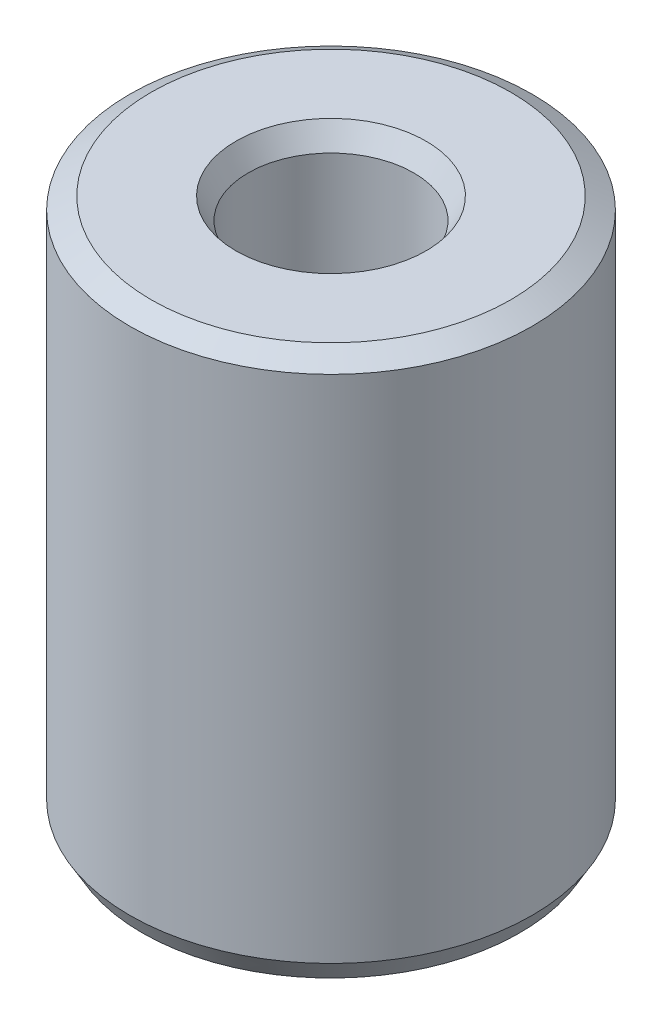
ISO-10303-21;
HEADER;
FILE_DESCRIPTION(('STEP AP214'),'2;1');
FILE_NAME('part.step','',(''),(''),'','','');
FILE_SCHEMA(('AUTOMOTIVE_DESIGN { 1 0 10303 214 1 1 1 1 }'));
ENDSEC;
DATA;
#1=APPLICATION_CONTEXT('core data for automotive mechanical design processes');
#2=APPLICATION_PROTOCOL_DEFINITION('international standard','automotive_design',2000,#1);
#3=PRODUCT_CONTEXT('',#1,'mechanical');
#4=PRODUCT('Part','Part','',(#3));
#5=PRODUCT_RELATED_PRODUCT_CATEGORY('part','',(#4));
#6=PRODUCT_DEFINITION_FORMATION('','',#4);
#7=PRODUCT_DEFINITION_CONTEXT('part definition',#1,'design');
#8=PRODUCT_DEFINITION('design','',#6,#7);
#9=PRODUCT_DEFINITION_SHAPE('','',#8);
#10=(LENGTH_UNIT() NAMED_UNIT(*) SI_UNIT(.MILLI.,.METRE.));
#11=(NAMED_UNIT(*) PLANE_ANGLE_UNIT() SI_UNIT($,.RADIAN.));
#12=(NAMED_UNIT(*) SI_UNIT($,.STERADIAN.) SOLID_ANGLE_UNIT());
#13=UNCERTAINTY_MEASURE_WITH_UNIT(LENGTH_MEASURE(1.E-05),#10,'distance_accuracy_value','');
#14=(GEOMETRIC_REPRESENTATION_CONTEXT(3) GLOBAL_UNCERTAINTY_ASSIGNED_CONTEXT((#13)) GLOBAL_UNIT_ASSIGNED_CONTEXT((#10,
#11,#12)) REPRESENTATION_CONTEXT('',''));
#15=CARTESIAN_POINT('',(0.,0.,0.));
#16=DIRECTION('',(0.,0.,1.));
#17=DIRECTION('',(1.,0.,0.));
#18=AXIS2_PLACEMENT_3D('',#15,#16,#17);
#19=CARTESIAN_POINT('',(0.,148.714564404981,0.));
#20=DIRECTION('',(0.,-1.,0.));
#21=DIRECTION('',(0.,0.,-1.));
#22=AXIS2_PLACEMENT_3D('',#19,#20,#21);
#23=CYLINDRICAL_SURFACE('',#22,55.);
#24=CARTESIAN_POINT('',(0.,5.82980812006137,0.));
#25=DIRECTION('',(0.,1.,0.));
#26=DIRECTION('',(0.,0.,1.));
#27=AXIS2_PLACEMENT_3D('',#24,#25,#26);
#28=CIRCLE('',#27,55.);
#29=CARTESIAN_POINT('',(0.,5.82980812006134,-55.));
#30=VERTEX_POINT('',#29);
#31=EDGE_CURVE('E10',#30,#30,#28,.T.);
#32=CARTESIAN_POINT('',(0.,145.34872311754,0.));
#33=DIRECTION('',(0.,1.,0.));
#34=DIRECTION('',(0.,0.,1.));
#35=AXIS2_PLACEMENT_3D('',#32,#33,#34);
#36=CIRCLE('',#35,55.);
#37=CARTESIAN_POINT('',(0.,145.34872311754,-55.));
#38=VERTEX_POINT('',#37);
#39=EDGE_CURVE('E50',#38,#38,#36,.F.);
#40=CARTESIAN_POINT('',(0.,5.82980812006134,-55.));
#41=CARTESIAN_POINT('',(0.,7.28313015128508,-55.));
#42=CARTESIAN_POINT('',(0.,8.73645218250881,-55.));
#43=CARTESIAN_POINT('',(0.,11.6430962449563,-55.));
#44=CARTESIAN_POINT('',(0.,13.09641827618,-55.));
#45=CARTESIAN_POINT('',(0.,16.0030623386275,-55.));
#46=CARTESIAN_POINT('',(0.,17.4563843698512,-55.));
#47=CARTESIAN_POINT('',(0.,20.3630284322987,-55.));
#48=CARTESIAN_POINT('',(0.,21.8163504635224,-55.));
#49=CARTESIAN_POINT('',(0.,24.7229945259699,-55.));
#50=CARTESIAN_POINT('',(0.,26.1763165571936,-55.));
#51=CARTESIAN_POINT('',(0.,29.0829606196411,-55.));
#52=CARTESIAN_POINT('',(0.,30.5362826508648,-55.));
#53=CARTESIAN_POINT('',(0.,33.4429267133123,-55.));
#54=CARTESIAN_POINT('',(0.,34.896248744536,-55.));
#55=CARTESIAN_POINT('',(0.,37.8028928069835,-55.));
#56=CARTESIAN_POINT('',(0.,39.2562148382072,-55.));
#57=CARTESIAN_POINT('',(0.,42.1628589006547,-55.));
#58=CARTESIAN_POINT('',(0.,43.6161809318784,-55.));
#59=CARTESIAN_POINT('',(0.,46.5228249943259,-55.));
#60=CARTESIAN_POINT('',(0.,47.9761470255497,-55.));
#61=CARTESIAN_POINT('',(0.,50.8827910879971,-55.));
#62=CARTESIAN_POINT('',(0.,52.3361131192209,-55.));
#63=CARTESIAN_POINT('',(0.,55.2427571816683,-55.));
#64=CARTESIAN_POINT('',(0.,56.6960792128921,-55.));
#65=CARTESIAN_POINT('',(0.,59.6027232753395,-55.));
#66=CARTESIAN_POINT('',(0.,61.0560453065633,-55.));
#67=CARTESIAN_POINT('',(0.,63.9626893690107,-55.));
#68=CARTESIAN_POINT('',(0.,65.4160114002345,-55.));
#69=CARTESIAN_POINT('',(0.,68.322655462682,-55.));
#70=CARTESIAN_POINT('',(0.,69.7759774939057,-55.));
#71=CARTESIAN_POINT('',(0.,72.6826215563532,-55.));
#72=CARTESIAN_POINT('',(0.,74.1359435875769,-55.));
#73=CARTESIAN_POINT('',(0.,77.0425876500244,-55.));
#74=CARTESIAN_POINT('',(0.,78.4959096812481,-55.));
#75=CARTESIAN_POINT('',(0.,81.4025537436956,-55.));
#76=CARTESIAN_POINT('',(0.,82.8558757749193,-55.));
#77=CARTESIAN_POINT('',(0.,85.7625198373668,-55.));
#78=CARTESIAN_POINT('',(0.,87.2158418685905,-55.));
#79=CARTESIAN_POINT('',(0.,90.122485931038,-55.));
#80=CARTESIAN_POINT('',(0.,91.5758079622617,-55.));
#81=CARTESIAN_POINT('',(0.,94.4824520247092,-55.));
#82=CARTESIAN_POINT('',(0.,95.9357740559329,-55.));
#83=CARTESIAN_POINT('',(0.,98.8424181183804,-55.));
#84=CARTESIAN_POINT('',(0.,100.295740149604,-55.));
#85=CARTESIAN_POINT('',(0.,103.202384212052,-55.));
#86=CARTESIAN_POINT('',(0.,104.655706243275,-55.));
#87=CARTESIAN_POINT('',(0.,107.562350305723,-55.));
#88=CARTESIAN_POINT('',(0.,109.015672336947,-55.));
#89=CARTESIAN_POINT('',(0.,111.922316399394,-55.));
#90=CARTESIAN_POINT('',(0.,113.375638430618,-55.));
#91=CARTESIAN_POINT('',(0.,116.282282493065,-55.));
#92=CARTESIAN_POINT('',(0.,117.735604524289,-55.));
#93=CARTESIAN_POINT('',(0.,120.642248586736,-55.));
#94=CARTESIAN_POINT('',(0.,122.09557061796,-55.));
#95=CARTESIAN_POINT('',(0.,125.002214680408,-55.));
#96=CARTESIAN_POINT('',(0.,126.455536711631,-55.));
#97=CARTESIAN_POINT('',(0.,129.362180774079,-55.));
#98=CARTESIAN_POINT('',(0.,130.815502805303,-55.));
#99=CARTESIAN_POINT('',(0.,133.72214686775,-55.));
#100=CARTESIAN_POINT('',(0.,135.175468898974,-55.));
#101=CARTESIAN_POINT('',(0.,138.082112961421,-55.));
#102=CARTESIAN_POINT('',(0.,139.535434992645,-55.));
#103=CARTESIAN_POINT('',(0.,142.442079055092,-55.));
#104=CARTESIAN_POINT('',(0.,143.895401086316,-55.));
#105=CARTESIAN_POINT('',(0.,145.34872311754,-55.));
#106=B_SPLINE_CURVE_WITH_KNOTS('',3,(#40,#41,#42,#43,#44,#45,#46,#47,#48,#49,#50,#51,#52,#53,
#54,#55,#56,#57,#58,#59,#60,#61,#62,#63,#64,#65,#66,#67,#68,#69,#70,#71,#72,#73,#74,#75,#76,#77,
#78,#79,#80,#81,#82,#83,#84,#85,#86,#87,#88,#89,#90,#91,#92,#93,#94,#95,#96,#97,#98,#99,#100,
#101,#102,#103,#104,#105),.UNSPECIFIED.,.F.,.F.,(4,2,2,2,2,2,2,2,2,2,2,2,2,2,2,2,2,2,2,2,2,2,2,
2,2,2,2,2,2,2,2,2,4),(0.,4.3599660936712,8.7199321873424,13.0798982810136,17.4398643746848,
21.799830468356,26.1597965620272,30.5197626556984,34.8797287493696,39.2396948430408,
43.599660936712,47.9596270303833,52.3195931240545,56.6795592177257,61.0395253113969,
65.3994914050681,69.7594574987393,74.1194235924105,78.4793896860817,82.8393557797529,
87.1993218734241,91.5592879670953,95.9192540607665,100.279220154438,104.639186248109,
108.99915234178,113.359118435451,117.719084529123,122.079050622794,126.439016716465,
130.798982810136,135.158948903807,139.518914997479),.UNSPECIFIED.);
#107=EDGE_CURVE('BSEAM39',#30,#38,#106,.T.);
#108=ORIENTED_EDGE('',*,*,#31,.T.);
#109=ORIENTED_EDGE('',*,*,#39,.T.);
#110=ORIENTED_EDGE('',*,*,#107,.T.);
#111=ORIENTED_EDGE('',*,*,#107,.F.);
#112=EDGE_LOOP('',(#108,#110,#109,#111));
#113=FACE_BOUND('',#112,.T.);
#114=ADVANCED_FACE('F39',(#113),#23,.T.);
#115=CARTESIAN_POINT('',(0.,148.714564404981,0.));
#116=DIRECTION('',(0.,1.,0.));
#117=DIRECTION('',(0.,0.,1.));
#118=AXIS2_PLACEMENT_3D('',#115,#116,#117);
#119=PLANE('',#118);
#120=CARTESIAN_POINT('',(0.,148.714564404981,0.));
#121=DIRECTION('',(0.,1.,0.));
#122=DIRECTION('',(0.,0.,1.));
#123=AXIS2_PLACEMENT_3D('',#120,#121,#122);
#124=CIRCLE('',#123,26.0031968891644);
#125=CARTESIAN_POINT('',(0.,148.714564404981,26.0031968891644));
#126=VERTEX_POINT('',#125);
#127=EDGE_CURVE('E58',#126,#126,#124,.F.);
#128=ORIENTED_EDGE('',*,*,#127,.T.);
#129=EDGE_LOOP('',(#128));
#130=FACE_BOUND('',#129,.T.);
#131=CARTESIAN_POINT('',(0.,148.714564404981,0.));
#132=DIRECTION('',(0.,1.,0.));
#133=DIRECTION('',(0.,0.,1.));
#134=AXIS2_PLACEMENT_3D('',#131,#132,#133);
#135=CIRCLE('',#134,49.1701918799391);
#136=CARTESIAN_POINT('',(0.,148.714564404981,49.1701918799391));
#137=VERTEX_POINT('',#136);
#138=EDGE_CURVE('E61',#137,#137,#135,.T.);
#139=ORIENTED_EDGE('',*,*,#138,.T.);
#140=EDGE_LOOP('',(#139));
#141=FACE_BOUND('',#140,.T.);
#142=ADVANCED_FACE('F88',(#130,#141),#119,.T.);
#143=CARTESIAN_POINT('',(0.,0.,0.));
#144=DIRECTION('',(0.,1.,0.));
#145=DIRECTION('',(0.,0.,1.));
#146=AXIS2_PLACEMENT_3D('',#143,#144,#145);
#147=PLANE('',#146);
#148=CARTESIAN_POINT('',(0.,0.,0.));
#149=DIRECTION('',(0.,1.,0.));
#150=DIRECTION('',(0.,0.,1.));
#151=AXIS2_PLACEMENT_3D('',#148,#149,#150);
#152=CIRCLE('',#151,28.4671637217841);
#153=CARTESIAN_POINT('',(0.,0.,28.4671637217841));
#154=VERTEX_POINT('',#153);
#155=EDGE_CURVE('E51',#154,#154,#152,.T.);
#156=ORIENTED_EDGE('',*,*,#155,.T.);
#157=EDGE_LOOP('',(#156));
#158=FACE_BOUND('',#157,.T.);
#159=CARTESIAN_POINT('',(0.,0.,0.));
#160=DIRECTION('',(0.,1.,0.));
#161=DIRECTION('',(0.,0.,1.));
#162=AXIS2_PLACEMENT_3D('',#159,#160,#161);
#163=CIRCLE('',#162,51.6341587125587);
#164=CARTESIAN_POINT('',(0.,0.,51.6341587125587));
#165=VERTEX_POINT('',#164);
#166=EDGE_CURVE('E54',#165,#165,#163,.F.);
#167=ORIENTED_EDGE('',*,*,#166,.T.);
#168=EDGE_LOOP('',(#167));
#169=FACE_BOUND('',#168,.T.);
#170=ADVANCED_FACE('F83',(#158,#169),#147,.F.);
#171=CARTESIAN_POINT('',(0.,148.714564404981,0.));
#172=DIRECTION('',(0.,-1.,0.));
#173=DIRECTION('',(0.,0.,-1.));
#174=AXIS2_PLACEMENT_3D('',#171,#172,#173);
#175=CYLINDRICAL_SURFACE('',#174,22.6373556017232);
#176=CARTESIAN_POINT('',(0.,142.88475628492,0.));
#177=DIRECTION('',(0.,1.,0.));
#178=DIRECTION('',(0.,0.,1.));
#179=AXIS2_PLACEMENT_3D('',#176,#177,#178);
#180=CIRCLE('',#179,22.6373556017232);
#181=CARTESIAN_POINT('',(0.,142.88475628492,-22.6373556017232));
#182=VERTEX_POINT('',#181);
#183=EDGE_CURVE('E67',#182,#182,#180,.T.);
#184=CARTESIAN_POINT('',(0.,3.36584128744111,0.));
#185=DIRECTION('',(0.,1.,0.));
#186=DIRECTION('',(0.,0.,1.));
#187=AXIS2_PLACEMENT_3D('',#184,#185,#186);
#188=CIRCLE('',#187,22.6373556017232);
#189=CARTESIAN_POINT('',(0.,3.36584128744111,-22.6373556017232));
#190=VERTEX_POINT('',#189);
#191=EDGE_CURVE('E69',#190,#190,#188,.F.);
#192=CARTESIAN_POINT('',(0.,142.88475628492,-22.6373556017232));
#193=CARTESIAN_POINT('',(0.,141.431434253696,-22.6373556017232));
#194=CARTESIAN_POINT('',(0.,139.978112222472,-22.6373556017232));
#195=CARTESIAN_POINT('',(0.,137.071468160025,-22.6373556017232));
#196=CARTESIAN_POINT('',(0.,135.618146128801,-22.6373556017232));
#197=CARTESIAN_POINT('',(0.,132.711502066354,-22.6373556017232));
#198=CARTESIAN_POINT('',(0.,131.25818003513,-22.6373556017232));
#199=CARTESIAN_POINT('',(0.,128.351535972682,-22.6373556017232));
#200=CARTESIAN_POINT('',(0.,126.898213941459,-22.6373556017232));
#201=CARTESIAN_POINT('',(0.,123.991569879011,-22.6373556017232));
#202=CARTESIAN_POINT('',(0.,122.538247847787,-22.6373556017232));
#203=CARTESIAN_POINT('',(0.,119.63160378534,-22.6373556017232));
#204=CARTESIAN_POINT('',(0.,118.178281754116,-22.6373556017232));
#205=CARTESIAN_POINT('',(0.,115.271637691669,-22.6373556017232));
#206=CARTESIAN_POINT('',(0.,113.818315660445,-22.6373556017232));
#207=CARTESIAN_POINT('',(0.,110.911671597998,-22.6373556017232));
#208=CARTESIAN_POINT('',(0.,109.458349566774,-22.6373556017232));
#209=CARTESIAN_POINT('',(0.,106.551705504326,-22.6373556017232));
#210=CARTESIAN_POINT('',(0.,105.098383473103,-22.6373556017232));
#211=CARTESIAN_POINT('',(0.,102.191739410655,-22.6373556017232));
#212=CARTESIAN_POINT('',(0.,100.738417379431,-22.6373556017232));
#213=CARTESIAN_POINT('',(0.,97.8317733169839,-22.6373556017232));
#214=CARTESIAN_POINT('',(0.,96.3784512857602,-22.6373556017232));
#215=CARTESIAN_POINT('',(0.,93.4718072233127,-22.6373556017232));
#216=CARTESIAN_POINT('',(0.,92.018485192089,-22.6373556017232));
#217=CARTESIAN_POINT('',(0.,89.1118411296415,-22.6373556017232));
#218=CARTESIAN_POINT('',(0.,87.6585190984178,-22.6373556017232));
#219=CARTESIAN_POINT('',(0.,84.7518750359703,-22.6373556017232));
#220=CARTESIAN_POINT('',(0.,83.2985530047466,-22.6373556017232));
#221=CARTESIAN_POINT('',(0.,80.3919089422991,-22.6373556017232));
#222=CARTESIAN_POINT('',(0.,78.9385869110754,-22.6373556017232));
#223=CARTESIAN_POINT('',(0.,76.0319428486279,-22.6373556017232));
#224=CARTESIAN_POINT('',(0.,74.5786208174042,-22.6373556017232));
#225=CARTESIAN_POINT('',(0.,71.6719767549567,-22.6373556017232));
#226=CARTESIAN_POINT('',(0.,70.218654723733,-22.6373556017232));
#227=CARTESIAN_POINT('',(0.,67.3120106612855,-22.6373556017232));
#228=CARTESIAN_POINT('',(0.,65.8586886300617,-22.6373556017232));
#229=CARTESIAN_POINT('',(0.,62.9520445676143,-22.6373556017232));
#230=CARTESIAN_POINT('',(0.,61.4987225363905,-22.6373556017232));
#231=CARTESIAN_POINT('',(0.,58.5920784739431,-22.6373556017232));
#232=CARTESIAN_POINT('',(0.,57.1387564427193,-22.6373556017232));
#233=CARTESIAN_POINT('',(0.,54.2321123802719,-22.6373556017232));
#234=CARTESIAN_POINT('',(0.,52.7787903490481,-22.6373556017232));
#235=CARTESIAN_POINT('',(0.,49.8721462866007,-22.6373556017232));
#236=CARTESIAN_POINT('',(0.,48.4188242553769,-22.6373556017232));
#237=CARTESIAN_POINT('',(0.,45.5121801929294,-22.6373556017232));
#238=CARTESIAN_POINT('',(0.,44.0588581617057,-22.6373556017232));
#239=CARTESIAN_POINT('',(0.,41.1522140992582,-22.6373556017232));
#240=CARTESIAN_POINT('',(0.,39.6988920680345,-22.6373556017232));
#241=CARTESIAN_POINT('',(0.,36.792248005587,-22.6373556017232));
#242=CARTESIAN_POINT('',(0.,35.3389259743633,-22.6373556017232));
#243=CARTESIAN_POINT('',(0.,32.4322819119158,-22.6373556017232));
#244=CARTESIAN_POINT('',(0.,30.9789598806921,-22.6373556017232));
#245=CARTESIAN_POINT('',(0.,28.0723158182446,-22.6373556017232));
#246=CARTESIAN_POINT('',(0.,26.6189937870209,-22.6373556017232));
#247=CARTESIAN_POINT('',(0.,23.7123497245734,-22.6373556017232));
#248=CARTESIAN_POINT('',(0.,22.2590276933497,-22.6373556017232));
#249=CARTESIAN_POINT('',(0.,19.3523836309022,-22.6373556017232));
#250=CARTESIAN_POINT('',(0.,17.8990615996785,-22.6373556017232));
#251=CARTESIAN_POINT('',(0.,14.992417537231,-22.6373556017232));
#252=CARTESIAN_POINT('',(0.,13.5390955060073,-22.6373556017232));
#253=CARTESIAN_POINT('',(0.,10.6324514435598,-22.6373556017232));
#254=CARTESIAN_POINT('',(0.,9.17912941233604,-22.6373556017232));
#255=CARTESIAN_POINT('',(0.,6.27248534988858,-22.6373556017232));
#256=CARTESIAN_POINT('',(0.,4.81916331866484,-22.6373556017232));
#257=CARTESIAN_POINT('',(0.,3.36584128744111,-22.6373556017232));
#258=B_SPLINE_CURVE_WITH_KNOTS('',3,(#192,#193,#194,#195,#196,#197,#198,#199,#200,#201,#202,
#203,#204,#205,#206,#207,#208,#209,#210,#211,#212,#213,#214,#215,#216,#217,#218,#219,#220,#221,
#222,#223,#224,#225,#226,#227,#228,#229,#230,#231,#232,#233,#234,#235,#236,#237,#238,#239,#240,
#241,#242,#243,#244,#245,#246,#247,#248,#249,#250,#251,#252,#253,#254,#255,#256,#257),
.UNSPECIFIED.,.F.,.F.,(4,2,2,2,2,2,2,2,2,2,2,2,2,2,2,2,2,2,2,2,2,2,2,2,2,2,2,2,2,2,2,2,4),(0.,
4.3599660936712,8.7199321873424,13.0798982810136,17.4398643746848,21.799830468356,
26.1597965620272,30.5197626556984,34.8797287493696,39.2396948430409,43.5996609367121,
47.9596270303833,52.3195931240545,56.6795592177257,61.0395253113969,65.3994914050681,
69.7594574987393,74.1194235924105,78.4793896860817,82.8393557797529,87.1993218734241,
91.5592879670953,95.9192540607665,100.279220154438,104.639186248109,108.99915234178,
113.359118435451,117.719084529123,122.079050622794,126.439016716465,130.798982810136,
135.158948903807,139.518914997479),.UNSPECIFIED.);
#259=EDGE_CURVE('BSEAM71',#182,#190,#258,.T.);
#260=ORIENTED_EDGE('',*,*,#183,.T.);
#261=ORIENTED_EDGE('',*,*,#191,.T.);
#262=ORIENTED_EDGE('',*,*,#259,.T.);
#263=ORIENTED_EDGE('',*,*,#259,.F.);
#264=EDGE_LOOP('',(#260,#262,#261,#263));
#265=FACE_BOUND('',#264,.T.);
#266=ADVANCED_FACE('F71',(#265),#175,.F.);
#267=CARTESIAN_POINT('',(0.,142.88475628492,0.));
#268=DIRECTION('',(0.,1.,0.));
#269=DIRECTION('',(0.,0.,1.));
#270=AXIS2_PLACEMENT_3D('',#267,#268,#269);
#271=CONICAL_SURFACE('',#270,22.6373556017232,0.523598775598299);
#272=ORIENTED_EDGE('',*,*,#127,.F.);
#273=EDGE_LOOP('',(#272));
#274=FACE_BOUND('',#273,.T.);
#275=ORIENTED_EDGE('',*,*,#183,.F.);
#276=EDGE_LOOP('',(#275));
#277=FACE_BOUND('',#276,.T.);
#278=ADVANCED_FACE('F77',(#274,#277),#271,.F.);
#279=CARTESIAN_POINT('',(0.,0.,0.));
#280=DIRECTION('',(0.,-1.,0.));
#281=DIRECTION('',(0.,0.,-1.));
#282=AXIS2_PLACEMENT_3D('',#279,#280,#281);
#283=CONICAL_SURFACE('',#282,28.4671637217841,1.04719755119659);
#284=ORIENTED_EDGE('',*,*,#191,.F.);
#285=EDGE_LOOP('',(#284));
#286=FACE_BOUND('',#285,.T.);
#287=ORIENTED_EDGE('',*,*,#155,.F.);
#288=EDGE_LOOP('',(#287));
#289=FACE_BOUND('',#288,.T.);
#290=ADVANCED_FACE('F73',(#286,#289),#283,.F.);
#291=CARTESIAN_POINT('',(0.,5.82980812006137,0.));
#292=DIRECTION('',(0.,1.,0.));
#293=DIRECTION('',(0.,0.,1.));
#294=AXIS2_PLACEMENT_3D('',#291,#292,#293);
#295=CONICAL_SURFACE('',#294,55.,0.523598775598304);
#296=ORIENTED_EDGE('',*,*,#166,.F.);
#297=EDGE_LOOP('',(#296));
#298=FACE_BOUND('',#297,.T.);
#299=ORIENTED_EDGE('',*,*,#31,.F.);
#300=EDGE_LOOP('',(#299));
#301=FACE_BOUND('',#300,.T.);
#302=ADVANCED_FACE('F76',(#298,#301),#295,.T.);
#303=CARTESIAN_POINT('',(0.,148.714564404981,0.));
#304=DIRECTION('',(0.,-1.,0.));
#305=DIRECTION('',(0.,0.,-1.));
#306=AXIS2_PLACEMENT_3D('',#303,#304,#305);
#307=CONICAL_SURFACE('',#306,49.1701918799391,1.0471975511966);
#308=ORIENTED_EDGE('',*,*,#39,.F.);
#309=EDGE_LOOP('',(#308));
#310=FACE_BOUND('',#309,.T.);
#311=ORIENTED_EDGE('',*,*,#138,.F.);
#312=EDGE_LOOP('',(#311));
#313=FACE_BOUND('',#312,.T.);
#314=ADVANCED_FACE('F45',(#310,#313),#307,.T.);
#315=CLOSED_SHELL('',(#114,#142,#170,#266,#278,#290,#302,#314));
#316=MANIFOLD_SOLID_BREP('B2',#315);
#317=ADVANCED_BREP_SHAPE_REPRESENTATION('',(#18,#316),#14);
#318=SHAPE_DEFINITION_REPRESENTATION(#9,#317);
ENDSEC;
END-ISO-10303-21;
